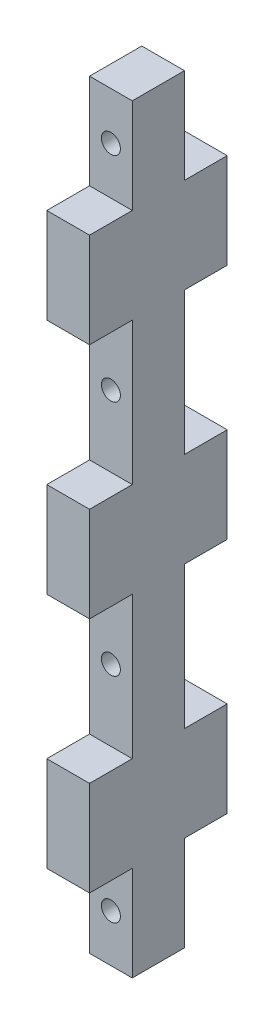
ISO-10303-21;
HEADER;
FILE_DESCRIPTION(('STEP AP214'),'2;1');
FILE_NAME('part.step','',(''),(''),'','','');
FILE_SCHEMA(('AUTOMOTIVE_DESIGN { 1 0 10303 214 1 1 1 1 }'));
ENDSEC;
DATA;
#1=APPLICATION_CONTEXT('core data for automotive mechanical design processes');
#2=APPLICATION_PROTOCOL_DEFINITION('international standard','automotive_design',2000,#1);
#3=PRODUCT_CONTEXT('',#1,'mechanical');
#4=PRODUCT('Part','Part','',(#3));
#5=PRODUCT_RELATED_PRODUCT_CATEGORY('part','',(#4));
#6=PRODUCT_DEFINITION_FORMATION('','',#4);
#7=PRODUCT_DEFINITION_CONTEXT('part definition',#1,'design');
#8=PRODUCT_DEFINITION('design','',#6,#7);
#9=PRODUCT_DEFINITION_SHAPE('','',#8);
#10=(LENGTH_UNIT() NAMED_UNIT(*) SI_UNIT(.MILLI.,.METRE.));
#11=(NAMED_UNIT(*) PLANE_ANGLE_UNIT() SI_UNIT($,.RADIAN.));
#12=(NAMED_UNIT(*) SI_UNIT($,.STERADIAN.) SOLID_ANGLE_UNIT());
#13=UNCERTAINTY_MEASURE_WITH_UNIT(LENGTH_MEASURE(1.E-05),#10,'distance_accuracy_value','');
#14=(GEOMETRIC_REPRESENTATION_CONTEXT(3) GLOBAL_UNCERTAINTY_ASSIGNED_CONTEXT((#13)) GLOBAL_UNIT_ASSIGNED_CONTEXT((#10,
#11,#12)) REPRESENTATION_CONTEXT('',''));
#15=CARTESIAN_POINT('',(0.,0.,0.));
#16=DIRECTION('',(0.,0.,1.));
#17=DIRECTION('',(1.,0.,0.));
#18=AXIS2_PLACEMENT_3D('',#15,#16,#17);
#19=CARTESIAN_POINT('',(0.,0.,20.));
#20=DIRECTION('',(0.,0.,-1.));
#21=DIRECTION('',(-1.,0.,0.));
#22=AXIS2_PLACEMENT_3D('',#19,#20,#21);
#23=PLANE('',#22);
#24=CARTESIAN_POINT('',(-47.5,200.,20.));
#25=DIRECTION('',(0.,0.,1.));
#26=DIRECTION('',(1.,0.,0.));
#27=AXIS2_PLACEMENT_3D('',#24,#25,#26);
#28=CIRCLE('',#27,2.);
#29=CARTESIAN_POINT('',(-45.5,200.,20.));
#30=VERTEX_POINT('',#29);
#31=EDGE_CURVE('E395',#30,#30,#28,.T.);
#32=ORIENTED_EDGE('',*,*,#31,.F.);
#33=EDGE_LOOP('',(#32));
#34=FACE_BOUND('',#33,.T.);
#35=DIRECTION('',(-1.,0.,0.));
#36=VECTOR('',#35,1.);
#37=CARTESIAN_POINT('',(0.,190.,20.));
#38=LINE('',#37,#36);
#39=CARTESIAN_POINT('',(-43.,190.,20.));
#40=VERTEX_POINT('',#39);
#41=CARTESIAN_POINT('',(-52.,190.,20.));
#42=VERTEX_POINT('',#41);
#43=EDGE_CURVE('E52',#40,#42,#38,.T.);
#44=ORIENTED_EDGE('',*,*,#43,.F.);
#45=DIRECTION('',(0.,1.,0.));
#46=VECTOR('',#45,1.);
#47=CARTESIAN_POINT('',(-43.,0.,20.));
#48=LINE('',#47,#46);
#49=CARTESIAN_POINT('',(-43.,210.,20.));
#50=VERTEX_POINT('',#49);
#51=EDGE_CURVE('E425',#40,#50,#48,.T.);
#52=ORIENTED_EDGE('',*,*,#51,.T.);
#53=DIRECTION('',(-1.,0.,0.));
#54=VECTOR('',#53,1.);
#55=CARTESIAN_POINT('',(0.,210.,20.));
#56=LINE('',#55,#54);
#57=CARTESIAN_POINT('',(-52.,210.,20.));
#58=VERTEX_POINT('',#57);
#59=EDGE_CURVE('E421',#50,#58,#56,.T.);
#60=ORIENTED_EDGE('',*,*,#59,.T.);
#61=DIRECTION('',(0.,1.,0.));
#62=VECTOR('',#61,1.);
#63=CARTESIAN_POINT('',(-52.,0.,20.));
#64=LINE('',#63,#62);
#65=EDGE_CURVE('E416',#42,#58,#64,.T.);
#66=ORIENTED_EDGE('',*,*,#65,.F.);
#67=EDGE_LOOP('',(#44,#52,#60,#66));
#68=FACE_BOUND('',#67,.T.);
#69=ADVANCED_FACE('F35',(#34,#68),#23,.F.);
#70=CARTESIAN_POINT('',(-47.5,155.,20.));
#71=DIRECTION('',(0.,0.,1.));
#72=DIRECTION('',(1.,0.,0.));
#73=AXIS2_PLACEMENT_3D('',#70,#71,#72);
#74=CIRCLE('',#73,2.);
#75=CARTESIAN_POINT('',(-45.5,155.,20.));
#76=VERTEX_POINT('',#75);
#77=EDGE_CURVE('E401',#76,#76,#74,.T.);
#78=ORIENTED_EDGE('',*,*,#77,.F.);
#79=EDGE_LOOP('',(#78));
#80=FACE_BOUND('',#79,.T.);
#81=DIRECTION('',(1.,0.,0.));
#82=VECTOR('',#81,1.);
#83=CARTESIAN_POINT('',(0.,170.,20.));
#84=LINE('',#83,#82);
#85=CARTESIAN_POINT('',(-52.,170.,20.));
#86=VERTEX_POINT('',#85);
#87=CARTESIAN_POINT('',(-43.,170.,20.));
#88=VERTEX_POINT('',#87);
#89=EDGE_CURVE('E232',#86,#88,#84,.T.);
#90=ORIENTED_EDGE('',*,*,#89,.F.);
#91=CARTESIAN_POINT('',(-52.,140.,20.));
#92=VERTEX_POINT('',#91);
#93=EDGE_CURVE('E228',#92,#86,#64,.T.);
#94=ORIENTED_EDGE('',*,*,#93,.F.);
#95=DIRECTION('',(-1.,0.,0.));
#96=VECTOR('',#95,1.);
#97=CARTESIAN_POINT('',(0.,140.,20.));
#98=LINE('',#97,#96);
#99=CARTESIAN_POINT('',(-43.,140.,20.));
#100=VERTEX_POINT('',#99);
#101=EDGE_CURVE('E287',#100,#92,#98,.T.);
#102=ORIENTED_EDGE('',*,*,#101,.F.);
#103=EDGE_CURVE('E430',#100,#88,#48,.T.);
#104=ORIENTED_EDGE('',*,*,#103,.T.);
#105=EDGE_LOOP('',(#90,#94,#102,#104));
#106=FACE_BOUND('',#105,.T.);
#107=ADVANCED_FACE('F523',(#80,#106),#23,.F.);
#108=CARTESIAN_POINT('',(-47.5,60.,20.));
#109=DIRECTION('',(0.,0.,1.));
#110=DIRECTION('',(1.,0.,0.));
#111=AXIS2_PLACEMENT_3D('',#108,#109,#110);
#112=CIRCLE('',#111,2.);
#113=CARTESIAN_POINT('',(-45.5,60.,20.));
#114=VERTEX_POINT('',#113);
#115=EDGE_CURVE('E389',#114,#114,#112,.T.);
#116=ORIENTED_EDGE('',*,*,#115,.F.);
#117=EDGE_LOOP('',(#116));
#118=FACE_BOUND('',#117,.T.);
#119=DIRECTION('',(1.,0.,0.));
#120=VECTOR('',#119,1.);
#121=CARTESIAN_POINT('',(0.,70.,20.));
#122=LINE('',#121,#120);
#123=CARTESIAN_POINT('',(-52.,70.,20.));
#124=VERTEX_POINT('',#123);
#125=CARTESIAN_POINT('',(-43.,70.,20.));
#126=VERTEX_POINT('',#125);
#127=EDGE_CURVE('E263',#124,#126,#122,.T.);
#128=ORIENTED_EDGE('',*,*,#127,.F.);
#129=CARTESIAN_POINT('',(-52.,50.,20.));
#130=VERTEX_POINT('',#129);
#131=EDGE_CURVE('E418',#130,#124,#64,.T.);
#132=ORIENTED_EDGE('',*,*,#131,.F.);
#133=DIRECTION('',(-1.,0.,0.));
#134=VECTOR('',#133,1.);
#135=CARTESIAN_POINT('',(0.,50.,20.));
#136=LINE('',#135,#134);
#137=CARTESIAN_POINT('',(-43.,50.,20.));
#138=VERTEX_POINT('',#137);
#139=EDGE_CURVE('E413',#138,#130,#136,.T.);
#140=ORIENTED_EDGE('',*,*,#139,.F.);
#141=EDGE_CURVE('E426',#138,#126,#48,.T.);
#142=ORIENTED_EDGE('',*,*,#141,.T.);
#143=EDGE_LOOP('',(#128,#132,#140,#142));
#144=FACE_BOUND('',#143,.T.);
#145=ADVANCED_FACE('F526',(#118,#144),#23,.F.);
#146=CARTESIAN_POINT('',(-47.5,105.,20.));
#147=DIRECTION('',(0.,0.,1.));
#148=DIRECTION('',(1.,0.,0.));
#149=AXIS2_PLACEMENT_3D('',#146,#147,#148);
#150=CIRCLE('',#149,2.);
#151=CARTESIAN_POINT('',(-45.5,105.,20.));
#152=VERTEX_POINT('',#151);
#153=EDGE_CURVE('E407',#152,#152,#150,.T.);
#154=ORIENTED_EDGE('',*,*,#153,.F.);
#155=EDGE_LOOP('',(#154));
#156=FACE_BOUND('',#155,.T.);
#157=DIRECTION('',(-1.,0.,0.));
#158=VECTOR('',#157,1.);
#159=CARTESIAN_POINT('',(0.,90.,20.));
#160=LINE('',#159,#158);
#161=CARTESIAN_POINT('',(-43.,90.,20.));
#162=VERTEX_POINT('',#161);
#163=CARTESIAN_POINT('',(-52.,90.,20.));
#164=VERTEX_POINT('',#163);
#165=EDGE_CURVE('E60',#162,#164,#160,.T.);
#166=ORIENTED_EDGE('',*,*,#165,.F.);
#167=CARTESIAN_POINT('',(-43.,120.,20.));
#168=VERTEX_POINT('',#167);
#169=EDGE_CURVE('E429',#162,#168,#48,.T.);
#170=ORIENTED_EDGE('',*,*,#169,.T.);
#171=DIRECTION('',(1.,0.,0.));
#172=VECTOR('',#171,1.);
#173=CARTESIAN_POINT('',(0.,120.,20.));
#174=LINE('',#173,#172);
#175=CARTESIAN_POINT('',(-52.,120.,20.));
#176=VERTEX_POINT('',#175);
#177=EDGE_CURVE('E282',#176,#168,#174,.T.);
#178=ORIENTED_EDGE('',*,*,#177,.F.);
#179=EDGE_CURVE('E422',#164,#176,#64,.T.);
#180=ORIENTED_EDGE('',*,*,#179,.F.);
#181=EDGE_LOOP('',(#166,#170,#178,#180));
#182=FACE_BOUND('',#181,.T.);
#183=ADVANCED_FACE('F531',(#156,#182),#23,.F.);
#184=CARTESIAN_POINT('',(0.,0.,9.));
#185=DIRECTION('',(0.,0.,-1.));
#186=DIRECTION('',(-1.,0.,0.));
#187=AXIS2_PLACEMENT_3D('',#184,#185,#186);
#188=PLANE('',#187);
#189=CARTESIAN_POINT('',(-47.5,105.,9.));
#190=DIRECTION('',(0.,0.,1.));
#191=DIRECTION('',(1.,0.,0.));
#192=AXIS2_PLACEMENT_3D('',#189,#190,#191);
#193=CIRCLE('',#192,2.);
#194=CARTESIAN_POINT('',(-45.5,105.,9.));
#195=VERTEX_POINT('',#194);
#196=EDGE_CURVE('E404',#195,#195,#193,.T.);
#197=ORIENTED_EDGE('',*,*,#196,.T.);
#198=EDGE_LOOP('',(#197));
#199=FACE_BOUND('',#198,.T.);
#200=DIRECTION('',(0.,1.,0.));
#201=VECTOR('',#200,1.);
#202=CARTESIAN_POINT('',(-43.,0.,9.));
#203=LINE('',#202,#201);
#204=CARTESIAN_POINT('',(-43.,90.,9.));
#205=VERTEX_POINT('',#204);
#206=CARTESIAN_POINT('',(-43.,120.,9.));
#207=VERTEX_POINT('',#206);
#208=EDGE_CURVE('E442',#205,#207,#203,.T.);
#209=ORIENTED_EDGE('',*,*,#208,.F.);
#210=DIRECTION('',(1.,0.,0.));
#211=VECTOR('',#210,1.);
#212=CARTESIAN_POINT('',(0.,90.,9.));
#213=LINE('',#212,#211);
#214=CARTESIAN_POINT('',(-52.,90.,9.));
#215=VERTEX_POINT('',#214);
#216=EDGE_CURVE('E315',#215,#205,#213,.T.);
#217=ORIENTED_EDGE('',*,*,#216,.F.);
#218=DIRECTION('',(0.,1.,0.));
#219=VECTOR('',#218,1.);
#220=CARTESIAN_POINT('',(-52.,0.,9.));
#221=LINE('',#220,#219);
#222=CARTESIAN_POINT('',(-52.,120.,9.));
#223=VERTEX_POINT('',#222);
#224=EDGE_CURVE('E437',#215,#223,#221,.T.);
#225=ORIENTED_EDGE('',*,*,#224,.T.);
#226=DIRECTION('',(-1.,0.,0.));
#227=VECTOR('',#226,1.);
#228=CARTESIAN_POINT('',(0.,120.,9.));
#229=LINE('',#228,#227);
#230=EDGE_CURVE('E337',#207,#223,#229,.T.);
#231=ORIENTED_EDGE('',*,*,#230,.F.);
#232=EDGE_LOOP('',(#209,#217,#225,#231));
#233=FACE_BOUND('',#232,.T.);
#234=ADVANCED_FACE('F476',(#199,#233),#188,.T.);
#235=CARTESIAN_POINT('',(-47.5,60.,9.));
#236=DIRECTION('',(0.,0.,1.));
#237=DIRECTION('',(1.,0.,0.));
#238=AXIS2_PLACEMENT_3D('',#235,#236,#237);
#239=CIRCLE('',#238,2.);
#240=CARTESIAN_POINT('',(-45.5,60.,9.));
#241=VERTEX_POINT('',#240);
#242=EDGE_CURVE('E366',#241,#241,#239,.T.);
#243=ORIENTED_EDGE('',*,*,#242,.T.);
#244=EDGE_LOOP('',(#243));
#245=FACE_BOUND('',#244,.T.);
#246=CARTESIAN_POINT('',(-52.,50.,9.));
#247=VERTEX_POINT('',#246);
#248=CARTESIAN_POINT('',(-52.,70.,9.));
#249=VERTEX_POINT('',#248);
#250=EDGE_CURVE('E434',#247,#249,#221,.T.);
#251=ORIENTED_EDGE('',*,*,#250,.T.);
#252=DIRECTION('',(-1.,0.,0.));
#253=VECTOR('',#252,1.);
#254=CARTESIAN_POINT('',(0.,70.,9.));
#255=LINE('',#254,#253);
#256=CARTESIAN_POINT('',(-43.,70.,9.));
#257=VERTEX_POINT('',#256);
#258=EDGE_CURVE('E311',#257,#249,#255,.T.);
#259=ORIENTED_EDGE('',*,*,#258,.F.);
#260=CARTESIAN_POINT('',(-43.,50.,9.));
#261=VERTEX_POINT('',#260);
#262=EDGE_CURVE('E417',#261,#257,#203,.T.);
#263=ORIENTED_EDGE('',*,*,#262,.F.);
#264=DIRECTION('',(-1.,0.,0.));
#265=VECTOR('',#264,1.);
#266=CARTESIAN_POINT('',(0.,50.,9.));
#267=LINE('',#266,#265);
#268=EDGE_CURVE('E410',#261,#247,#267,.T.);
#269=ORIENTED_EDGE('',*,*,#268,.T.);
#270=EDGE_LOOP('',(#251,#259,#263,#269));
#271=FACE_BOUND('',#270,.T.);
#272=ADVANCED_FACE('F456',(#245,#271),#188,.T.);
#273=CARTESIAN_POINT('',(-47.5,155.,9.));
#274=DIRECTION('',(0.,0.,1.));
#275=DIRECTION('',(1.,0.,0.));
#276=AXIS2_PLACEMENT_3D('',#273,#274,#275);
#277=CIRCLE('',#276,2.);
#278=CARTESIAN_POINT('',(-45.5,155.,9.));
#279=VERTEX_POINT('',#278);
#280=EDGE_CURVE('E398',#279,#279,#277,.T.);
#281=ORIENTED_EDGE('',*,*,#280,.T.);
#282=EDGE_LOOP('',(#281));
#283=FACE_BOUND('',#282,.T.);
#284=CARTESIAN_POINT('',(-43.,140.,9.));
#285=VERTEX_POINT('',#284);
#286=CARTESIAN_POINT('',(-43.,170.,9.));
#287=VERTEX_POINT('',#286);
#288=EDGE_CURVE('E479',#285,#287,#203,.T.);
#289=ORIENTED_EDGE('',*,*,#288,.F.);
#290=DIRECTION('',(1.,0.,0.));
#291=VECTOR('',#290,1.);
#292=CARTESIAN_POINT('',(0.,140.,9.));
#293=LINE('',#292,#291);
#294=CARTESIAN_POINT('',(-52.,140.,9.));
#295=VERTEX_POINT('',#294);
#296=EDGE_CURVE('E340',#295,#285,#293,.T.);
#297=ORIENTED_EDGE('',*,*,#296,.F.);
#298=CARTESIAN_POINT('',(-52.,170.,9.00000000000001));
#299=VERTEX_POINT('',#298);
#300=EDGE_CURVE('E493',#295,#299,#221,.T.);
#301=ORIENTED_EDGE('',*,*,#300,.T.);
#302=DIRECTION('',(-1.,0.,0.));
#303=VECTOR('',#302,1.);
#304=CARTESIAN_POINT('',(0.,170.,9.));
#305=LINE('',#304,#303);
#306=EDGE_CURVE('E367',#287,#299,#305,.T.);
#307=ORIENTED_EDGE('',*,*,#306,.F.);
#308=EDGE_LOOP('',(#289,#297,#301,#307));
#309=FACE_BOUND('',#308,.T.);
#310=ADVANCED_FACE('F497',(#283,#309),#188,.T.);
#311=DIRECTION('',(1.,0.,0.));
#312=VECTOR('',#311,1.);
#313=CARTESIAN_POINT('',(0.,190.,9.));
#314=LINE('',#313,#312);
#315=CARTESIAN_POINT('',(-52.,190.,9.));
#316=VERTEX_POINT('',#315);
#317=CARTESIAN_POINT('',(-43.,190.,9.));
#318=VERTEX_POINT('',#317);
#319=EDGE_CURVE('E363',#316,#318,#314,.T.);
#320=ORIENTED_EDGE('',*,*,#319,.F.);
#321=CARTESIAN_POINT('',(-52.,210.,9.));
#322=VERTEX_POINT('',#321);
#323=EDGE_CURVE('E433',#316,#322,#221,.T.);
#324=ORIENTED_EDGE('',*,*,#323,.T.);
#325=DIRECTION('',(-1.,0.,0.));
#326=VECTOR('',#325,1.);
#327=CARTESIAN_POINT('',(0.,210.,9.));
#328=LINE('',#327,#326);
#329=CARTESIAN_POINT('',(-43.,210.,9.));
#330=VERTEX_POINT('',#329);
#331=EDGE_CURVE('E436',#330,#322,#328,.T.);
#332=ORIENTED_EDGE('',*,*,#331,.F.);
#333=EDGE_CURVE('E440',#318,#330,#203,.T.);
#334=ORIENTED_EDGE('',*,*,#333,.F.);
#335=EDGE_LOOP('',(#320,#324,#332,#334));
#336=FACE_BOUND('',#335,.T.);
#337=CARTESIAN_POINT('',(-47.5,200.,9.));
#338=DIRECTION('',(0.,0.,1.));
#339=DIRECTION('',(1.,0.,0.));
#340=AXIS2_PLACEMENT_3D('',#337,#338,#339);
#341=CIRCLE('',#340,2.);
#342=CARTESIAN_POINT('',(-45.5,200.,9.));
#343=VERTEX_POINT('',#342);
#344=EDGE_CURVE('E392',#343,#343,#341,.T.);
#345=ORIENTED_EDGE('',*,*,#344,.T.);
#346=EDGE_LOOP('',(#345));
#347=FACE_BOUND('',#346,.T.);
#348=ADVANCED_FACE('F490',(#336,#347),#188,.T.);
#349=CARTESIAN_POINT('',(0.,50.,20.));
#350=DIRECTION('',(0.,-1.,0.));
#351=DIRECTION('',(0.,0.,-1.));
#352=AXIS2_PLACEMENT_3D('',#349,#350,#351);
#353=PLANE('',#352);
#354=ORIENTED_EDGE('',*,*,#268,.F.);
#355=DIRECTION('',(0.,0.,-1.));
#356=VECTOR('',#355,1.);
#357=CARTESIAN_POINT('',(-43.,50.,20.));
#358=LINE('',#357,#356);
#359=EDGE_CURVE('E11',#138,#261,#358,.T.);
#360=ORIENTED_EDGE('',*,*,#359,.F.);
#361=ORIENTED_EDGE('',*,*,#139,.T.);
#362=DIRECTION('',(0.,0.,-1.));
#363=VECTOR('',#362,1.);
#364=CARTESIAN_POINT('',(-52.,50.,20.));
#365=LINE('',#364,#363);
#366=EDGE_CURVE('E39',#130,#247,#365,.T.);
#367=ORIENTED_EDGE('',*,*,#366,.T.);
#368=EDGE_LOOP('',(#354,#360,#361,#367));
#369=FACE_BOUND('',#368,.T.);
#370=ADVANCED_FACE('F37',(#369),#353,.T.);
#371=CARTESIAN_POINT('',(-43.,0.,20.));
#372=DIRECTION('',(-1.,0.,0.));
#373=DIRECTION('',(0.,0.,1.));
#374=AXIS2_PLACEMENT_3D('',#371,#372,#373);
#375=PLANE('',#374);
#376=ORIENTED_EDGE('',*,*,#262,.T.);
#377=DIRECTION('',(0.,0.,-1.));
#378=VECTOR('',#377,1.);
#379=CARTESIAN_POINT('',(-43.,70.,30.9317121994613));
#380=LINE('',#379,#378);
#381=CARTESIAN_POINT('',(-43.,70.,0.));
#382=VERTEX_POINT('',#381);
#383=EDGE_CURVE('E331',#257,#382,#380,.T.);
#384=ORIENTED_EDGE('',*,*,#383,.T.);
#385=DIRECTION('',(0.,1.,0.));
#386=VECTOR('',#385,1.);
#387=CARTESIAN_POINT('',(-43.0000000000001,0.,0.));
#388=LINE('',#387,#386);
#389=CARTESIAN_POINT('',(-43.,90.,0.));
#390=VERTEX_POINT('',#389);
#391=EDGE_CURVE('E321',#382,#390,#388,.T.);
#392=ORIENTED_EDGE('',*,*,#391,.T.);
#393=DIRECTION('',(0.,0.,-1.));
#394=VECTOR('',#393,1.);
#395=CARTESIAN_POINT('',(-43.,90.,30.9317121994613));
#396=LINE('',#395,#394);
#397=EDGE_CURVE('E329',#205,#390,#396,.T.);
#398=ORIENTED_EDGE('',*,*,#397,.F.);
#399=ORIENTED_EDGE('',*,*,#208,.T.);
#400=DIRECTION('',(0.,0.,-1.));
#401=VECTOR('',#400,1.);
#402=CARTESIAN_POINT('',(-43.,120.,30.9317121994613));
#403=LINE('',#402,#401);
#404=CARTESIAN_POINT('',(-43.,120.,0.));
#405=VERTEX_POINT('',#404);
#406=EDGE_CURVE('E358',#207,#405,#403,.T.);
#407=ORIENTED_EDGE('',*,*,#406,.T.);
#408=DIRECTION('',(0.,1.,0.));
#409=VECTOR('',#408,1.);
#410=CARTESIAN_POINT('',(-43.,0.,0.));
#411=LINE('',#410,#409);
#412=CARTESIAN_POINT('',(-43.,140.,0.));
#413=VERTEX_POINT('',#412);
#414=EDGE_CURVE('E353',#405,#413,#411,.T.);
#415=ORIENTED_EDGE('',*,*,#414,.T.);
#416=DIRECTION('',(0.,0.,-1.));
#417=VECTOR('',#416,1.);
#418=CARTESIAN_POINT('',(-43.,140.,30.9317121994613));
#419=LINE('',#418,#417);
#420=EDGE_CURVE('E356',#285,#413,#419,.T.);
#421=ORIENTED_EDGE('',*,*,#420,.F.);
#422=ORIENTED_EDGE('',*,*,#288,.T.);
#423=DIRECTION('',(0.,0.,-1.));
#424=VECTOR('',#423,1.);
#425=CARTESIAN_POINT('',(-43.,170.,30.9317121994613));
#426=LINE('',#425,#424);
#427=CARTESIAN_POINT('',(-43.,170.,0.));
#428=VERTEX_POINT('',#427);
#429=EDGE_CURVE('E379',#287,#428,#426,.T.);
#430=ORIENTED_EDGE('',*,*,#429,.T.);
#431=DIRECTION('',(0.,1.,0.));
#432=VECTOR('',#431,1.);
#433=CARTESIAN_POINT('',(-43.,0.,0.));
#434=LINE('',#433,#432);
#435=CARTESIAN_POINT('',(-43.,190.,0.));
#436=VERTEX_POINT('',#435);
#437=EDGE_CURVE('E344',#428,#436,#434,.T.);
#438=ORIENTED_EDGE('',*,*,#437,.T.);
#439=DIRECTION('',(0.,0.,-1.));
#440=VECTOR('',#439,1.);
#441=CARTESIAN_POINT('',(-43.,190.,30.9317121994613));
#442=LINE('',#441,#440);
#443=EDGE_CURVE('E385',#318,#436,#442,.T.);
#444=ORIENTED_EDGE('',*,*,#443,.F.);
#445=ORIENTED_EDGE('',*,*,#333,.T.);
#446=DIRECTION('',(0.,0.,-1.));
#447=VECTOR('',#446,1.);
#448=CARTESIAN_POINT('',(-43.,210.,20.));
#449=LINE('',#448,#447);
#450=EDGE_CURVE('E44',#50,#330,#449,.T.);
#451=ORIENTED_EDGE('',*,*,#450,.F.);
#452=ORIENTED_EDGE('',*,*,#51,.F.);
#453=DIRECTION('',(0.,0.,-1.));
#454=VECTOR('',#453,1.);
#455=CARTESIAN_POINT('',(-43.,190.,50.9317121994613));
#456=LINE('',#455,#454);
#457=CARTESIAN_POINT('',(-43.,190.,29.));
#458=VERTEX_POINT('',#457);
#459=EDGE_CURVE('E256',#458,#40,#456,.T.);
#460=ORIENTED_EDGE('',*,*,#459,.F.);
#461=DIRECTION('',(0.,1.,0.));
#462=VECTOR('',#461,1.);
#463=CARTESIAN_POINT('',(-43.,0.,29.));
#464=LINE('',#463,#462);
#465=CARTESIAN_POINT('',(-43.,170.,29.));
#466=VERTEX_POINT('',#465);
#467=EDGE_CURVE('E242',#466,#458,#464,.T.);
#468=ORIENTED_EDGE('',*,*,#467,.F.);
#469=DIRECTION('',(0.,0.,-1.));
#470=VECTOR('',#469,1.);
#471=CARTESIAN_POINT('',(-43.,170.,50.9317121994613));
#472=LINE('',#471,#470);
#473=EDGE_CURVE('E238',#466,#88,#472,.T.);
#474=ORIENTED_EDGE('',*,*,#473,.T.);
#475=ORIENTED_EDGE('',*,*,#103,.F.);
#476=DIRECTION('',(0.,0.,-1.));
#477=VECTOR('',#476,1.);
#478=CARTESIAN_POINT('',(-43.,140.,50.9317121994613));
#479=LINE('',#478,#477);
#480=CARTESIAN_POINT('',(-43.,140.,29.));
#481=VERTEX_POINT('',#480);
#482=EDGE_CURVE('E291',#481,#100,#479,.T.);
#483=ORIENTED_EDGE('',*,*,#482,.F.);
#484=DIRECTION('',(0.,1.,0.));
#485=VECTOR('',#484,1.);
#486=CARTESIAN_POINT('',(-43.,0.,29.));
#487=LINE('',#486,#485);
#488=CARTESIAN_POINT('',(-43.,120.,29.));
#489=VERTEX_POINT('',#488);
#490=EDGE_CURVE('E299',#489,#481,#487,.T.);
#491=ORIENTED_EDGE('',*,*,#490,.F.);
#492=DIRECTION('',(0.,0.,-1.));
#493=VECTOR('',#492,1.);
#494=CARTESIAN_POINT('',(-43.,120.,50.9317121994613));
#495=LINE('',#494,#493);
#496=EDGE_CURVE('E270',#489,#168,#495,.T.);
#497=ORIENTED_EDGE('',*,*,#496,.T.);
#498=ORIENTED_EDGE('',*,*,#169,.F.);
#499=DIRECTION('',(0.,0.,-1.));
#500=VECTOR('',#499,1.);
#501=CARTESIAN_POINT('',(-43.,90.,50.9317121994613));
#502=LINE('',#501,#500);
#503=CARTESIAN_POINT('',(-43.,90.,29.));
#504=VERTEX_POINT('',#503);
#505=EDGE_CURVE('E262',#504,#162,#502,.T.);
#506=ORIENTED_EDGE('',*,*,#505,.F.);
#507=DIRECTION('',(0.,1.,0.));
#508=VECTOR('',#507,1.);
#509=CARTESIAN_POINT('',(-43.0000000000001,0.,29.));
#510=LINE('',#509,#508);
#511=CARTESIAN_POINT('',(-43.,70.,29.));
#512=VERTEX_POINT('',#511);
#513=EDGE_CURVE('E267',#512,#504,#510,.T.);
#514=ORIENTED_EDGE('',*,*,#513,.F.);
#515=DIRECTION('',(0.,0.,-1.));
#516=VECTOR('',#515,1.);
#517=CARTESIAN_POINT('',(-43.,70.,50.9317121994613));
#518=LINE('',#517,#516);
#519=EDGE_CURVE('E266',#512,#126,#518,.T.);
#520=ORIENTED_EDGE('',*,*,#519,.T.);
#521=ORIENTED_EDGE('',*,*,#141,.F.);
#522=ORIENTED_EDGE('',*,*,#359,.T.);
#523=EDGE_LOOP('',(#376,#384,#392,#398,#399,#407,#415,#421,#422,#430,#438,#444,#445,#451,#452,
#460,#468,#474,#475,#483,#491,#497,#498,#506,#514,#520,#521,#522));
#524=FACE_BOUND('',#523,.T.);
#525=ADVANCED_FACE('F459',(#524),#375,.F.);
#526=CARTESIAN_POINT('',(0.,210.,20.));
#527=DIRECTION('',(0.,-1.,0.));
#528=DIRECTION('',(0.,0.,-1.));
#529=AXIS2_PLACEMENT_3D('',#526,#527,#528);
#530=PLANE('',#529);
#531=ORIENTED_EDGE('',*,*,#331,.T.);
#532=DIRECTION('',(0.,0.,-1.));
#533=VECTOR('',#532,1.);
#534=CARTESIAN_POINT('',(-52.,210.,20.));
#535=LINE('',#534,#533);
#536=EDGE_CURVE('E445',#58,#322,#535,.T.);
#537=ORIENTED_EDGE('',*,*,#536,.F.);
#538=ORIENTED_EDGE('',*,*,#59,.F.);
#539=ORIENTED_EDGE('',*,*,#450,.T.);
#540=EDGE_LOOP('',(#531,#537,#538,#539));
#541=FACE_BOUND('',#540,.T.);
#542=ADVANCED_FACE('F489',(#541),#530,.F.);
#543=CARTESIAN_POINT('',(-52.,0.,20.));
#544=DIRECTION('',(-1.,0.,0.));
#545=DIRECTION('',(0.,0.,1.));
#546=AXIS2_PLACEMENT_3D('',#543,#544,#545);
#547=PLANE('',#546);
#548=ORIENTED_EDGE('',*,*,#250,.F.);
#549=ORIENTED_EDGE('',*,*,#366,.F.);
#550=ORIENTED_EDGE('',*,*,#131,.T.);
#551=DIRECTION('',(0.,0.,-1.));
#552=VECTOR('',#551,1.);
#553=CARTESIAN_POINT('',(-52.,70.,50.9317121994613));
#554=LINE('',#553,#552);
#555=CARTESIAN_POINT('',(-52.,70.,29.));
#556=VERTEX_POINT('',#555);
#557=EDGE_CURVE('E249',#556,#124,#554,.T.);
#558=ORIENTED_EDGE('',*,*,#557,.F.);
#559=DIRECTION('',(0.,-1.,0.));
#560=VECTOR('',#559,1.);
#561=CARTESIAN_POINT('',(-52.,0.,29.));
#562=LINE('',#561,#560);
#563=CARTESIAN_POINT('',(-52.,90.,29.));
#564=VERTEX_POINT('',#563);
#565=EDGE_CURVE('E274',#564,#556,#562,.T.);
#566=ORIENTED_EDGE('',*,*,#565,.F.);
#567=DIRECTION('',(0.,0.,-1.));
#568=VECTOR('',#567,1.);
#569=CARTESIAN_POINT('',(-52.,90.,50.9317121994613));
#570=LINE('',#569,#568);
#571=EDGE_CURVE('E247',#564,#164,#570,.T.);
#572=ORIENTED_EDGE('',*,*,#571,.T.);
#573=ORIENTED_EDGE('',*,*,#179,.T.);
#574=DIRECTION('',(0.,0.,-1.));
#575=VECTOR('',#574,1.);
#576=CARTESIAN_POINT('',(-52.,120.,50.9317121994613));
#577=LINE('',#576,#575);
#578=CARTESIAN_POINT('',(-52.,120.,29.));
#579=VERTEX_POINT('',#578);
#580=EDGE_CURVE('E286',#579,#176,#577,.T.);
#581=ORIENTED_EDGE('',*,*,#580,.F.);
#582=DIRECTION('',(0.,-1.,0.));
#583=VECTOR('',#582,1.);
#584=CARTESIAN_POINT('',(-52.,0.,29.));
#585=LINE('',#584,#583);
#586=CARTESIAN_POINT('',(-52.,140.,29.));
#587=VERTEX_POINT('',#586);
#588=EDGE_CURVE('E292',#587,#579,#585,.T.);
#589=ORIENTED_EDGE('',*,*,#588,.F.);
#590=DIRECTION('',(0.,0.,-1.));
#591=VECTOR('',#590,1.);
#592=CARTESIAN_POINT('',(-52.,140.,50.9317121994613));
#593=LINE('',#592,#591);
#594=EDGE_CURVE('E290',#587,#92,#593,.T.);
#595=ORIENTED_EDGE('',*,*,#594,.T.);
#596=ORIENTED_EDGE('',*,*,#93,.T.);
#597=DIRECTION('',(0.,0.,-1.));
#598=VECTOR('',#597,1.);
#599=CARTESIAN_POINT('',(-52.,170.,50.9317121994613));
#600=LINE('',#599,#598);
#601=CARTESIAN_POINT('',(-52.,170.,29.));
#602=VERTEX_POINT('',#601);
#603=EDGE_CURVE('E221',#602,#86,#600,.T.);
#604=ORIENTED_EDGE('',*,*,#603,.F.);
#605=DIRECTION('',(0.,-1.,0.));
#606=VECTOR('',#605,1.);
#607=CARTESIAN_POINT('',(-52.,0.,29.));
#608=LINE('',#607,#606);
#609=CARTESIAN_POINT('',(-52.,190.,29.));
#610=VERTEX_POINT('',#609);
#611=EDGE_CURVE('E226',#610,#602,#608,.T.);
#612=ORIENTED_EDGE('',*,*,#611,.F.);
#613=DIRECTION('',(0.,0.,-1.));
#614=VECTOR('',#613,1.);
#615=CARTESIAN_POINT('',(-52.,190.,50.9317121994613));
#616=LINE('',#615,#614);
#617=EDGE_CURVE('E233',#610,#42,#616,.T.);
#618=ORIENTED_EDGE('',*,*,#617,.T.);
#619=ORIENTED_EDGE('',*,*,#65,.T.);
#620=ORIENTED_EDGE('',*,*,#536,.T.);
#621=ORIENTED_EDGE('',*,*,#323,.F.);
#622=DIRECTION('',(0.,0.,-1.));
#623=VECTOR('',#622,1.);
#624=CARTESIAN_POINT('',(-52.,190.,30.9317121994613));
#625=LINE('',#624,#623);
#626=CARTESIAN_POINT('',(-52.,190.,0.));
#627=VERTEX_POINT('',#626);
#628=EDGE_CURVE('E383',#316,#627,#625,.T.);
#629=ORIENTED_EDGE('',*,*,#628,.T.);
#630=DIRECTION('',(0.,-1.,0.));
#631=VECTOR('',#630,1.);
#632=CARTESIAN_POINT('',(-52.,0.,0.));
#633=LINE('',#632,#631);
#634=CARTESIAN_POINT('',(-52.,170.,0.));
#635=VERTEX_POINT('',#634);
#636=EDGE_CURVE('E373',#627,#635,#633,.T.);
#637=ORIENTED_EDGE('',*,*,#636,.T.);
#638=DIRECTION('',(0.,0.,-1.));
#639=VECTOR('',#638,1.);
#640=CARTESIAN_POINT('',(-52.,170.,30.9317121994613));
#641=LINE('',#640,#639);
#642=EDGE_CURVE('E381',#299,#635,#641,.T.);
#643=ORIENTED_EDGE('',*,*,#642,.F.);
#644=ORIENTED_EDGE('',*,*,#300,.F.);
#645=DIRECTION('',(0.,0.,-1.));
#646=VECTOR('',#645,1.);
#647=CARTESIAN_POINT('',(-52.,140.,30.9317121994613));
#648=LINE('',#647,#646);
#649=CARTESIAN_POINT('',(-52.,140.,0.));
#650=VERTEX_POINT('',#649);
#651=EDGE_CURVE('E341',#295,#650,#648,.T.);
#652=ORIENTED_EDGE('',*,*,#651,.T.);
#653=DIRECTION('',(0.,-1.,0.));
#654=VECTOR('',#653,1.);
#655=CARTESIAN_POINT('',(-52.,0.,0.));
#656=LINE('',#655,#654);
#657=CARTESIAN_POINT('',(-52.,120.,0.));
#658=VERTEX_POINT('',#657);
#659=EDGE_CURVE('E347',#650,#658,#656,.T.);
#660=ORIENTED_EDGE('',*,*,#659,.T.);
#661=DIRECTION('',(0.,0.,-1.));
#662=VECTOR('',#661,1.);
#663=CARTESIAN_POINT('',(-52.,120.,30.9317121994613));
#664=LINE('',#663,#662);
#665=EDGE_CURVE('E360',#223,#658,#664,.T.);
#666=ORIENTED_EDGE('',*,*,#665,.F.);
#667=ORIENTED_EDGE('',*,*,#224,.F.);
#668=DIRECTION('',(0.,0.,-1.));
#669=VECTOR('',#668,1.);
#670=CARTESIAN_POINT('',(-52.,90.,30.9317121994613));
#671=LINE('',#670,#669);
#672=CARTESIAN_POINT('',(-52.,90.,0.));
#673=VERTEX_POINT('',#672);
#674=EDGE_CURVE('E327',#215,#673,#671,.T.);
#675=ORIENTED_EDGE('',*,*,#674,.T.);
#676=DIRECTION('',(0.,-1.,0.));
#677=VECTOR('',#676,1.);
#678=CARTESIAN_POINT('',(-52.,0.,0.));
#679=LINE('',#678,#677);
#680=CARTESIAN_POINT('',(-52.,70.,0.));
#681=VERTEX_POINT('',#680);
#682=EDGE_CURVE('E295',#673,#681,#679,.T.);
#683=ORIENTED_EDGE('',*,*,#682,.T.);
#684=DIRECTION('',(0.,0.,-1.));
#685=VECTOR('',#684,1.);
#686=CARTESIAN_POINT('',(-52.,70.,30.9317121994613));
#687=LINE('',#686,#685);
#688=EDGE_CURVE('E333',#249,#681,#687,.T.);
#689=ORIENTED_EDGE('',*,*,#688,.F.);
#690=EDGE_LOOP('',(#548,#549,#550,#558,#566,#572,#573,#581,#589,#595,#596,#604,#612,#618,#619,
#620,#621,#629,#637,#643,#644,#652,#660,#666,#667,#675,#683,#689));
#691=FACE_BOUND('',#690,.T.);
#692=ADVANCED_FACE('F224',(#691),#547,.T.);
#693=CARTESIAN_POINT('',(-47.5,105.,20.));
#694=DIRECTION('',(0.,0.,-1.));
#695=DIRECTION('',(-1.,0.,0.));
#696=AXIS2_PLACEMENT_3D('',#693,#694,#695);
#697=CYLINDRICAL_SURFACE('',#696,2.);
#698=ORIENTED_EDGE('',*,*,#153,.T.);
#699=EDGE_LOOP('',(#698));
#700=FACE_BOUND('',#699,.T.);
#701=ORIENTED_EDGE('',*,*,#196,.F.);
#702=EDGE_LOOP('',(#701));
#703=FACE_BOUND('',#702,.T.);
#704=ADVANCED_FACE('F610',(#700,#703),#697,.F.);
#705=CARTESIAN_POINT('',(-47.5,155.,20.));
#706=DIRECTION('',(0.,0.,-1.));
#707=DIRECTION('',(-1.,0.,0.));
#708=AXIS2_PLACEMENT_3D('',#705,#706,#707);
#709=CYLINDRICAL_SURFACE('',#708,2.);
#710=ORIENTED_EDGE('',*,*,#77,.T.);
#711=EDGE_LOOP('',(#710));
#712=FACE_BOUND('',#711,.T.);
#713=ORIENTED_EDGE('',*,*,#280,.F.);
#714=EDGE_LOOP('',(#713));
#715=FACE_BOUND('',#714,.T.);
#716=ADVANCED_FACE('F604',(#712,#715),#709,.F.);
#717=CARTESIAN_POINT('',(-47.5,200.,20.));
#718=DIRECTION('',(0.,0.,-1.));
#719=DIRECTION('',(-1.,0.,0.));
#720=AXIS2_PLACEMENT_3D('',#717,#718,#719);
#721=CYLINDRICAL_SURFACE('',#720,2.);
#722=ORIENTED_EDGE('',*,*,#31,.T.);
#723=EDGE_LOOP('',(#722));
#724=FACE_BOUND('',#723,.T.);
#725=ORIENTED_EDGE('',*,*,#344,.F.);
#726=EDGE_LOOP('',(#725));
#727=FACE_BOUND('',#726,.T.);
#728=ADVANCED_FACE('F599',(#724,#727),#721,.F.);
#729=CARTESIAN_POINT('',(-47.5,60.,20.));
#730=DIRECTION('',(0.,0.,-1.));
#731=DIRECTION('',(-1.,0.,0.));
#732=AXIS2_PLACEMENT_3D('',#729,#730,#731);
#733=CYLINDRICAL_SURFACE('',#732,2.);
#734=ORIENTED_EDGE('',*,*,#115,.T.);
#735=EDGE_LOOP('',(#734));
#736=FACE_BOUND('',#735,.T.);
#737=ORIENTED_EDGE('',*,*,#242,.F.);
#738=EDGE_LOOP('',(#737));
#739=FACE_BOUND('',#738,.T.);
#740=ADVANCED_FACE('F595',(#736,#739),#733,.F.);
#741=CARTESIAN_POINT('',(0.,0.,0.));
#742=DIRECTION('',(0.,0.,1.));
#743=DIRECTION('',(1.,0.,0.));
#744=AXIS2_PLACEMENT_3D('',#741,#742,#743);
#745=PLANE('',#744);
#746=ORIENTED_EDGE('',*,*,#437,.F.);
#747=DIRECTION('',(1.,0.,0.));
#748=VECTOR('',#747,1.);
#749=CARTESIAN_POINT('',(0.,170.,0.));
#750=LINE('',#749,#748);
#751=EDGE_CURVE('E376',#635,#428,#750,.T.);
#752=ORIENTED_EDGE('',*,*,#751,.F.);
#753=ORIENTED_EDGE('',*,*,#636,.F.);
#754=DIRECTION('',(-1.,0.,0.));
#755=VECTOR('',#754,1.);
#756=CARTESIAN_POINT('',(0.,190.,0.));
#757=LINE('',#756,#755);
#758=EDGE_CURVE('E370',#436,#627,#757,.T.);
#759=ORIENTED_EDGE('',*,*,#758,.F.);
#760=EDGE_LOOP('',(#746,#752,#753,#759));
#761=FACE_BOUND('',#760,.T.);
#762=ADVANCED_FACE('F507',(#761),#745,.F.);
#763=CARTESIAN_POINT('',(0.,170.,30.9317121994613));
#764=DIRECTION('',(0.,1.,0.));
#765=DIRECTION('',(0.,0.,1.));
#766=AXIS2_PLACEMENT_3D('',#763,#764,#765);
#767=PLANE('',#766);
#768=ORIENTED_EDGE('',*,*,#429,.F.);
#769=ORIENTED_EDGE('',*,*,#306,.T.);
#770=ORIENTED_EDGE('',*,*,#642,.T.);
#771=ORIENTED_EDGE('',*,*,#751,.T.);
#772=EDGE_LOOP('',(#768,#769,#770,#771));
#773=FACE_BOUND('',#772,.T.);
#774=ADVANCED_FACE('F503',(#773),#767,.F.);
#775=CARTESIAN_POINT('',(0.,190.,30.9317121994613));
#776=DIRECTION('',(0.,-1.,0.));
#777=DIRECTION('',(0.,0.,-1.));
#778=AXIS2_PLACEMENT_3D('',#775,#776,#777);
#779=PLANE('',#778);
#780=ORIENTED_EDGE('',*,*,#628,.F.);
#781=ORIENTED_EDGE('',*,*,#319,.T.);
#782=ORIENTED_EDGE('',*,*,#443,.T.);
#783=ORIENTED_EDGE('',*,*,#758,.T.);
#784=EDGE_LOOP('',(#780,#781,#782,#783));
#785=FACE_BOUND('',#784,.T.);
#786=ADVANCED_FACE('F509',(#785),#779,.F.);
#787=CARTESIAN_POINT('',(0.,0.,0.));
#788=DIRECTION('',(0.,0.,1.));
#789=DIRECTION('',(1.,0.,0.));
#790=AXIS2_PLACEMENT_3D('',#787,#788,#789);
#791=PLANE('',#790);
#792=DIRECTION('',(-1.,0.,0.));
#793=VECTOR('',#792,1.);
#794=CARTESIAN_POINT('',(0.,140.,0.));
#795=LINE('',#794,#793);
#796=EDGE_CURVE('E314',#413,#650,#795,.T.);
#797=ORIENTED_EDGE('',*,*,#796,.F.);
#798=ORIENTED_EDGE('',*,*,#414,.F.);
#799=DIRECTION('',(1.,0.,0.));
#800=VECTOR('',#799,1.);
#801=CARTESIAN_POINT('',(0.,120.,0.));
#802=LINE('',#801,#800);
#803=EDGE_CURVE('E350',#658,#405,#802,.T.);
#804=ORIENTED_EDGE('',*,*,#803,.F.);
#805=ORIENTED_EDGE('',*,*,#659,.F.);
#806=EDGE_LOOP('',(#797,#798,#804,#805));
#807=FACE_BOUND('',#806,.T.);
#808=ADVANCED_FACE('F511',(#807),#791,.F.);
#809=CARTESIAN_POINT('',(0.,120.,30.9317121994613));
#810=DIRECTION('',(0.,1.,0.));
#811=DIRECTION('',(0.,0.,1.));
#812=AXIS2_PLACEMENT_3D('',#809,#810,#811);
#813=PLANE('',#812);
#814=ORIENTED_EDGE('',*,*,#406,.F.);
#815=ORIENTED_EDGE('',*,*,#230,.T.);
#816=ORIENTED_EDGE('',*,*,#665,.T.);
#817=ORIENTED_EDGE('',*,*,#803,.T.);
#818=EDGE_LOOP('',(#814,#815,#816,#817));
#819=FACE_BOUND('',#818,.T.);
#820=ADVANCED_FACE('F517',(#819),#813,.F.);
#821=CARTESIAN_POINT('',(0.,140.,30.9317121994613));
#822=DIRECTION('',(0.,-1.,0.));
#823=DIRECTION('',(0.,0.,-1.));
#824=AXIS2_PLACEMENT_3D('',#821,#822,#823);
#825=PLANE('',#824);
#826=ORIENTED_EDGE('',*,*,#651,.F.);
#827=ORIENTED_EDGE('',*,*,#296,.T.);
#828=ORIENTED_EDGE('',*,*,#420,.T.);
#829=ORIENTED_EDGE('',*,*,#796,.T.);
#830=EDGE_LOOP('',(#826,#827,#828,#829));
#831=FACE_BOUND('',#830,.T.);
#832=ADVANCED_FACE('F583',(#831),#825,.F.);
#833=CARTESIAN_POINT('',(0.,0.,0.));
#834=DIRECTION('',(0.,0.,1.));
#835=DIRECTION('',(1.,0.,0.));
#836=AXIS2_PLACEMENT_3D('',#833,#834,#835);
#837=PLANE('',#836);
#838=ORIENTED_EDGE('',*,*,#682,.F.);
#839=DIRECTION('',(-1.,0.,0.));
#840=VECTOR('',#839,1.);
#841=CARTESIAN_POINT('',(0.,90.,0.));
#842=LINE('',#841,#840);
#843=EDGE_CURVE('E324',#390,#673,#842,.T.);
#844=ORIENTED_EDGE('',*,*,#843,.F.);
#845=ORIENTED_EDGE('',*,*,#391,.F.);
#846=DIRECTION('',(1.,0.,0.));
#847=VECTOR('',#846,1.);
#848=CARTESIAN_POINT('',(0.,70.,0.));
#849=LINE('',#848,#847);
#850=EDGE_CURVE('E318',#681,#382,#849,.T.);
#851=ORIENTED_EDGE('',*,*,#850,.F.);
#852=EDGE_LOOP('',(#838,#844,#845,#851));
#853=FACE_BOUND('',#852,.T.);
#854=ADVANCED_FACE('F468',(#853),#837,.F.);
#855=CARTESIAN_POINT('',(0.,90.,30.9317121994613));
#856=DIRECTION('',(0.,-1.,0.));
#857=DIRECTION('',(0.,0.,-1.));
#858=AXIS2_PLACEMENT_3D('',#855,#856,#857);
#859=PLANE('',#858);
#860=ORIENTED_EDGE('',*,*,#674,.F.);
#861=ORIENTED_EDGE('',*,*,#216,.T.);
#862=ORIENTED_EDGE('',*,*,#397,.T.);
#863=ORIENTED_EDGE('',*,*,#843,.T.);
#864=EDGE_LOOP('',(#860,#861,#862,#863));
#865=FACE_BOUND('',#864,.T.);
#866=ADVANCED_FACE('F474',(#865),#859,.F.);
#867=CARTESIAN_POINT('',(0.,70.,30.9317121994613));
#868=DIRECTION('',(0.,1.,0.));
#869=DIRECTION('',(0.,0.,1.));
#870=AXIS2_PLACEMENT_3D('',#867,#868,#869);
#871=PLANE('',#870);
#872=ORIENTED_EDGE('',*,*,#383,.F.);
#873=ORIENTED_EDGE('',*,*,#258,.T.);
#874=ORIENTED_EDGE('',*,*,#688,.T.);
#875=ORIENTED_EDGE('',*,*,#850,.T.);
#876=EDGE_LOOP('',(#872,#873,#874,#875));
#877=FACE_BOUND('',#876,.T.);
#878=ADVANCED_FACE('F462',(#877),#871,.F.);
#879=CARTESIAN_POINT('',(0.,140.,50.9317121994613));
#880=DIRECTION('',(0.,-1.,0.));
#881=DIRECTION('',(0.,0.,-1.));
#882=AXIS2_PLACEMENT_3D('',#879,#880,#881);
#883=PLANE('',#882);
#884=DIRECTION('',(-1.,0.,0.));
#885=VECTOR('',#884,1.);
#886=CARTESIAN_POINT('',(0.,140.,29.));
#887=LINE('',#886,#885);
#888=EDGE_CURVE('E296',#481,#587,#887,.T.);
#889=ORIENTED_EDGE('',*,*,#888,.F.);
#890=ORIENTED_EDGE('',*,*,#482,.T.);
#891=ORIENTED_EDGE('',*,*,#101,.T.);
#892=ORIENTED_EDGE('',*,*,#594,.F.);
#893=EDGE_LOOP('',(#889,#890,#891,#892));
#894=FACE_BOUND('',#893,.T.);
#895=ADVANCED_FACE('F568',(#894),#883,.F.);
#896=CARTESIAN_POINT('',(0.,120.,50.9317121994613));
#897=DIRECTION('',(0.,1.,0.));
#898=DIRECTION('',(0.,0.,1.));
#899=AXIS2_PLACEMENT_3D('',#896,#897,#898);
#900=PLANE('',#899);
#901=DIRECTION('',(1.,0.,0.));
#902=VECTOR('',#901,1.);
#903=CARTESIAN_POINT('',(0.,120.,29.));
#904=LINE('',#903,#902);
#905=EDGE_CURVE('E285',#579,#489,#904,.T.);
#906=ORIENTED_EDGE('',*,*,#905,.F.);
#907=ORIENTED_EDGE('',*,*,#580,.T.);
#908=ORIENTED_EDGE('',*,*,#177,.T.);
#909=ORIENTED_EDGE('',*,*,#496,.F.);
#910=EDGE_LOOP('',(#906,#907,#908,#909));
#911=FACE_BOUND('',#910,.T.);
#912=ADVANCED_FACE('F564',(#911),#900,.F.);
#913=CARTESIAN_POINT('',(0.,0.,29.));
#914=DIRECTION('',(0.,0.,1.));
#915=DIRECTION('',(1.,0.,0.));
#916=AXIS2_PLACEMENT_3D('',#913,#914,#915);
#917=PLANE('',#916);
#918=ORIENTED_EDGE('',*,*,#905,.T.);
#919=ORIENTED_EDGE('',*,*,#490,.T.);
#920=ORIENTED_EDGE('',*,*,#888,.T.);
#921=ORIENTED_EDGE('',*,*,#588,.T.);
#922=EDGE_LOOP('',(#918,#919,#920,#921));
#923=FACE_BOUND('',#922,.T.);
#924=ADVANCED_FACE('F569',(#923),#917,.T.);
#925=CARTESIAN_POINT('',(0.,70.,50.9317121994613));
#926=DIRECTION('',(0.,1.,0.));
#927=DIRECTION('',(0.,0.,1.));
#928=AXIS2_PLACEMENT_3D('',#925,#926,#927);
#929=PLANE('',#928);
#930=DIRECTION('',(1.,0.,0.));
#931=VECTOR('',#930,1.);
#932=CARTESIAN_POINT('',(0.,70.,29.));
#933=LINE('',#932,#931);
#934=EDGE_CURVE('E271',#556,#512,#933,.T.);
#935=ORIENTED_EDGE('',*,*,#934,.F.);
#936=ORIENTED_EDGE('',*,*,#557,.T.);
#937=ORIENTED_EDGE('',*,*,#127,.T.);
#938=ORIENTED_EDGE('',*,*,#519,.F.);
#939=EDGE_LOOP('',(#935,#936,#937,#938));
#940=FACE_BOUND('',#939,.T.);
#941=ADVANCED_FACE('F571',(#940),#929,.F.);
#942=CARTESIAN_POINT('',(0.,90.,50.9317121994613));
#943=DIRECTION('',(0.,-1.,0.));
#944=DIRECTION('',(0.,0.,-1.));
#945=AXIS2_PLACEMENT_3D('',#942,#943,#944);
#946=PLANE('',#945);
#947=DIRECTION('',(-1.,0.,0.));
#948=VECTOR('',#947,1.);
#949=CARTESIAN_POINT('',(0.,90.,29.));
#950=LINE('',#949,#948);
#951=EDGE_CURVE('E261',#504,#564,#950,.T.);
#952=ORIENTED_EDGE('',*,*,#951,.F.);
#953=ORIENTED_EDGE('',*,*,#505,.T.);
#954=ORIENTED_EDGE('',*,*,#165,.T.);
#955=ORIENTED_EDGE('',*,*,#571,.F.);
#956=EDGE_LOOP('',(#952,#953,#954,#955));
#957=FACE_BOUND('',#956,.T.);
#958=ADVANCED_FACE('F552',(#957),#946,.F.);
#959=CARTESIAN_POINT('',(0.,0.,29.));
#960=DIRECTION('',(0.,0.,1.));
#961=DIRECTION('',(1.,0.,0.));
#962=AXIS2_PLACEMENT_3D('',#959,#960,#961);
#963=PLANE('',#962);
#964=ORIENTED_EDGE('',*,*,#951,.T.);
#965=ORIENTED_EDGE('',*,*,#565,.T.);
#966=ORIENTED_EDGE('',*,*,#934,.T.);
#967=ORIENTED_EDGE('',*,*,#513,.T.);
#968=EDGE_LOOP('',(#964,#965,#966,#967));
#969=FACE_BOUND('',#968,.T.);
#970=ADVANCED_FACE('F550',(#969),#963,.T.);
#971=CARTESIAN_POINT('',(0.,190.,50.9317121994613));
#972=DIRECTION('',(0.,-1.,0.));
#973=DIRECTION('',(0.,0.,-1.));
#974=AXIS2_PLACEMENT_3D('',#971,#972,#973);
#975=PLANE('',#974);
#976=DIRECTION('',(-1.,0.,0.));
#977=VECTOR('',#976,1.);
#978=CARTESIAN_POINT('',(0.,190.,29.));
#979=LINE('',#978,#977);
#980=EDGE_CURVE('E246',#458,#610,#979,.T.);
#981=ORIENTED_EDGE('',*,*,#980,.F.);
#982=ORIENTED_EDGE('',*,*,#459,.T.);
#983=ORIENTED_EDGE('',*,*,#43,.T.);
#984=ORIENTED_EDGE('',*,*,#617,.F.);
#985=EDGE_LOOP('',(#981,#982,#983,#984));
#986=FACE_BOUND('',#985,.T.);
#987=ADVANCED_FACE('F709',(#986),#975,.F.);
#988=CARTESIAN_POINT('',(0.,170.,50.9317121994613));
#989=DIRECTION('',(0.,1.,0.));
#990=DIRECTION('',(0.,0.,1.));
#991=AXIS2_PLACEMENT_3D('',#988,#989,#990);
#992=PLANE('',#991);
#993=DIRECTION('',(1.,0.,0.));
#994=VECTOR('',#993,1.);
#995=CARTESIAN_POINT('',(0.,170.,29.));
#996=LINE('',#995,#994);
#997=EDGE_CURVE('E236',#602,#466,#996,.T.);
#998=ORIENTED_EDGE('',*,*,#997,.F.);
#999=ORIENTED_EDGE('',*,*,#603,.T.);
#1000=ORIENTED_EDGE('',*,*,#89,.T.);
#1001=ORIENTED_EDGE('',*,*,#473,.F.);
#1002=EDGE_LOOP('',(#998,#999,#1000,#1001));
#1003=FACE_BOUND('',#1002,.T.);
#1004=ADVANCED_FACE('F237',(#1003),#992,.F.);
#1005=CARTESIAN_POINT('',(0.,0.,29.));
#1006=DIRECTION('',(0.,0.,1.));
#1007=DIRECTION('',(1.,0.,0.));
#1008=AXIS2_PLACEMENT_3D('',#1005,#1006,#1007);
#1009=PLANE('',#1008);
#1010=ORIENTED_EDGE('',*,*,#997,.T.);
#1011=ORIENTED_EDGE('',*,*,#467,.T.);
#1012=ORIENTED_EDGE('',*,*,#980,.T.);
#1013=ORIENTED_EDGE('',*,*,#611,.T.);
#1014=EDGE_LOOP('',(#1010,#1011,#1012,#1013));
#1015=FACE_BOUND('',#1014,.T.);
#1016=ADVANCED_FACE('F245',(#1015),#1009,.T.);
#1017=CLOSED_SHELL('',(#69,#107,#145,#183,#234,#272,#310,#348,#370,#525,#542,#692,#704,#716,
#728,#740,#762,#774,#786,#808,#820,#832,#854,#866,#878,#895,#912,#924,#941,#958,#970,#987,#1004,#1016));
#1018=MANIFOLD_SOLID_BREP('B2',#1017);
#1019=ADVANCED_BREP_SHAPE_REPRESENTATION('',(#18,#1018),#14);
#1020=SHAPE_DEFINITION_REPRESENTATION(#9,#1019);
ENDSEC;
END-ISO-10303-21;
